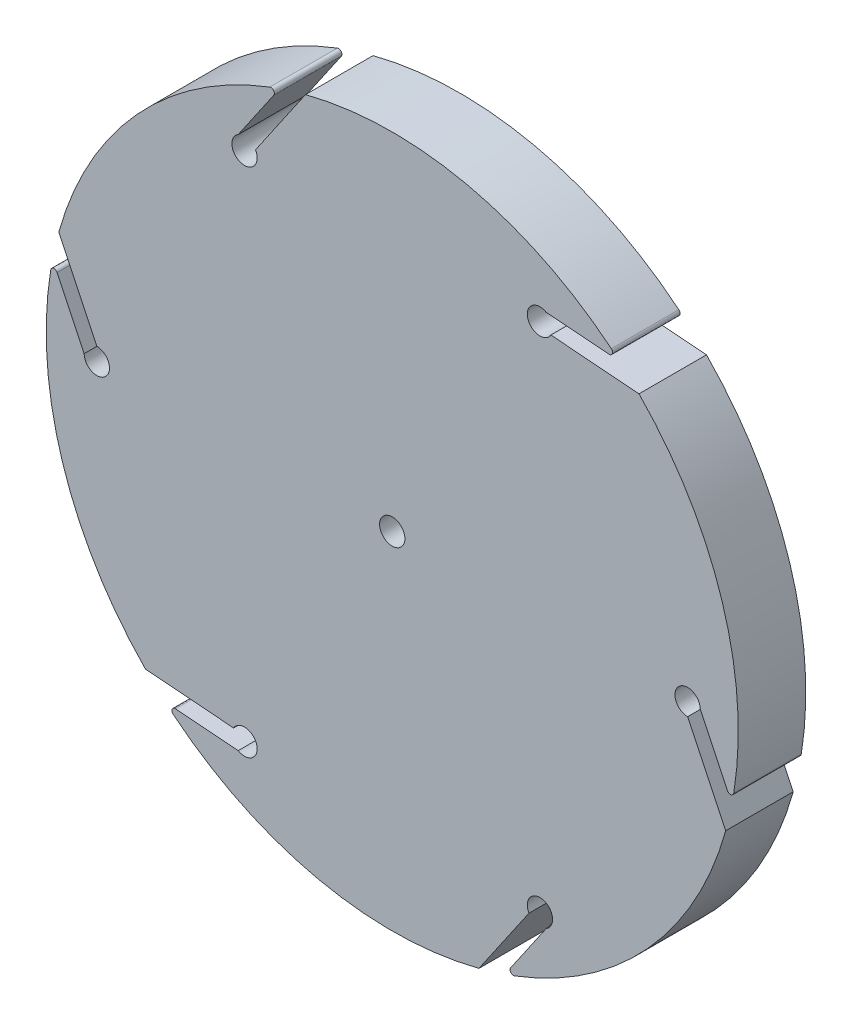
ISO-10303-21;
HEADER;
FILE_DESCRIPTION(('STEP AP214'),'2;1');
FILE_NAME('part.step','',(''),(''),'','','');
FILE_SCHEMA(('AUTOMOTIVE_DESIGN { 1 0 10303 214 1 1 1 1 }'));
ENDSEC;
DATA;
#1=APPLICATION_CONTEXT('core data for automotive mechanical design processes');
#2=APPLICATION_PROTOCOL_DEFINITION('international standard','automotive_design',2000,#1);
#3=PRODUCT_CONTEXT('',#1,'mechanical');
#4=PRODUCT('Part','Part','',(#3));
#5=PRODUCT_RELATED_PRODUCT_CATEGORY('part','',(#4));
#6=PRODUCT_DEFINITION_FORMATION('','',#4);
#7=PRODUCT_DEFINITION_CONTEXT('part definition',#1,'design');
#8=PRODUCT_DEFINITION('design','',#6,#7);
#9=PRODUCT_DEFINITION_SHAPE('','',#8);
#10=(LENGTH_UNIT() NAMED_UNIT(*) SI_UNIT(.MILLI.,.METRE.));
#11=(NAMED_UNIT(*) PLANE_ANGLE_UNIT() SI_UNIT($,.RADIAN.));
#12=(NAMED_UNIT(*) SI_UNIT($,.STERADIAN.) SOLID_ANGLE_UNIT());
#13=UNCERTAINTY_MEASURE_WITH_UNIT(LENGTH_MEASURE(1.E-05),#10,'distance_accuracy_value','');
#14=(GEOMETRIC_REPRESENTATION_CONTEXT(3) GLOBAL_UNCERTAINTY_ASSIGNED_CONTEXT((#13)) GLOBAL_UNIT_ASSIGNED_CONTEXT((#10,
#11,#12)) REPRESENTATION_CONTEXT('',''));
#15=CARTESIAN_POINT('',(0.,0.,0.));
#16=DIRECTION('',(0.,0.,1.));
#17=DIRECTION('',(1.,0.,0.));
#18=AXIS2_PLACEMENT_3D('',#15,#16,#17);
#19=CARTESIAN_POINT('',(0.,0.,4.));
#20=DIRECTION('',(0.,0.,-1.));
#21=DIRECTION('',(-1.,0.,0.));
#22=AXIS2_PLACEMENT_3D('',#19,#20,#21);
#23=CYLINDRICAL_SURFACE('',#22,20.5000000000002);
#24=CARTESIAN_POINT('',(0.,0.,4.));
#25=DIRECTION('',(0.,0.,1.));
#26=DIRECTION('',(1.,0.,0.));
#27=AXIS2_PLACEMENT_3D('',#24,#25,#26);
#28=CIRCLE('',#27,20.5000000000002);
#29=CARTESIAN_POINT('',(-12.9778392059693,-15.869016653341,4.));
#30=VERTEX_POINT('',#29);
#31=CARTESIAN_POINT('',(5.13786996078102,-19.8457121884328,4.));
#32=VERTEX_POINT('',#31);
#33=EDGE_CURVE('E399',#30,#32,#28,.T.);
#34=ORIENTED_EDGE('',*,*,#33,.F.);
#35=DIRECTION('',(0.,0.,-1.));
#36=VECTOR('',#35,1.);
#37=CARTESIAN_POINT('',(-12.9778392059693,-15.869016653341,4.));
#38=LINE('',#37,#36);
#39=CARTESIAN_POINT('',(-12.9778392059693,-15.869016653341,0.));
#40=VERTEX_POINT('',#39);
#41=EDGE_CURVE('E431',#30,#40,#38,.T.);
#42=ORIENTED_EDGE('',*,*,#41,.T.);
#43=CARTESIAN_POINT('',(0.,0.,0.));
#44=DIRECTION('',(0.,0.,1.));
#45=DIRECTION('',(1.,0.,0.));
#46=AXIS2_PLACEMENT_3D('',#43,#44,#45);
#47=CIRCLE('',#46,20.5000000000002);
#48=CARTESIAN_POINT('',(5.13786996078102,-19.8457121884328,0.));
#49=VERTEX_POINT('',#48);
#50=EDGE_CURVE('E239',#40,#49,#47,.T.);
#51=ORIENTED_EDGE('',*,*,#50,.T.);
#52=DIRECTION('',(0.,0.,1.));
#53=VECTOR('',#52,1.);
#54=CARTESIAN_POINT('',(5.13786996078102,-19.8457121884328,0.));
#55=LINE('',#54,#53);
#56=EDGE_CURVE('E281',#49,#32,#55,.T.);
#57=ORIENTED_EDGE('',*,*,#56,.T.);
#58=EDGE_LOOP('',(#34,#42,#51,#57));
#59=FACE_BOUND('',#58,.T.);
#60=ADVANCED_FACE('F32',(#59),#23,.T.);
#61=CARTESIAN_POINT('',(7.25405195188701,-19.1736467652696,4.));
#62=VERTEX_POINT('',#61);
#63=CARTESIAN_POINT('',(19.7558258917678,-5.47333018683903,4.));
#64=VERTEX_POINT('',#63);
#65=EDGE_CURVE('E476',#62,#64,#28,.T.);
#66=ORIENTED_EDGE('',*,*,#65,.F.);
#67=DIRECTION('',(0.,0.,-1.));
#68=VECTOR('',#67,1.);
#69=CARTESIAN_POINT('',(7.25405195188701,-19.1736467652696,4.));
#70=LINE('',#69,#68);
#71=CARTESIAN_POINT('',(7.25405195188701,-19.1736467652696,0.));
#72=VERTEX_POINT('',#71);
#73=EDGE_CURVE('E55',#62,#72,#70,.T.);
#74=ORIENTED_EDGE('',*,*,#73,.T.);
#75=CARTESIAN_POINT('',(19.7558258917678,-5.47333018683903,0.));
#76=VERTEX_POINT('',#75);
#77=EDGE_CURVE('E241',#72,#76,#47,.T.);
#78=ORIENTED_EDGE('',*,*,#77,.T.);
#79=DIRECTION('',(0.,0.,1.));
#80=VECTOR('',#79,1.);
#81=CARTESIAN_POINT('',(19.7558258917678,-5.47333018683903,0.));
#82=LINE('',#81,#80);
#83=EDGE_CURVE('E299',#76,#64,#82,.T.);
#84=ORIENTED_EDGE('',*,*,#83,.T.);
#85=EDGE_LOOP('',(#66,#74,#78,#84));
#86=FACE_BOUND('',#85,.T.);
#87=ADVANCED_FACE('F533',(#86),#23,.T.);
#88=CARTESIAN_POINT('',(20.2318911578563,-3.30463011192849,4.));
#89=VERTEX_POINT('',#88);
#90=CARTESIAN_POINT('',(14.6179559309867,14.3723820015938,4.));
#91=VERTEX_POINT('',#90);
#92=EDGE_CURVE('E474',#89,#91,#28,.T.);
#93=ORIENTED_EDGE('',*,*,#92,.F.);
#94=DIRECTION('',(0.,0.,-1.));
#95=VECTOR('',#94,1.);
#96=CARTESIAN_POINT('',(20.2318911578563,-3.30463011192849,4.));
#97=LINE('',#96,#95);
#98=CARTESIAN_POINT('',(20.2318911578563,-3.30463011192849,0.));
#99=VERTEX_POINT('',#98);
#100=EDGE_CURVE('E440',#89,#99,#97,.T.);
#101=ORIENTED_EDGE('',*,*,#100,.T.);
#102=CARTESIAN_POINT('',(14.6179559309867,14.3723820015938,0.));
#103=VERTEX_POINT('',#102);
#104=EDGE_CURVE('E401',#99,#103,#47,.T.);
#105=ORIENTED_EDGE('',*,*,#104,.T.);
#106=DIRECTION('',(0.,0.,1.));
#107=VECTOR('',#106,1.);
#108=CARTESIAN_POINT('',(14.6179559309867,14.3723820015938,0.));
#109=LINE('',#108,#107);
#110=EDGE_CURVE('E317',#103,#91,#109,.T.);
#111=ORIENTED_EDGE('',*,*,#110,.T.);
#112=EDGE_LOOP('',(#93,#101,#105,#111));
#113=FACE_BOUND('',#112,.T.);
#114=ADVANCED_FACE('F498',(#113),#23,.T.);
#115=CARTESIAN_POINT('',(12.9778392059692,15.8690166533411,4.));
#116=VERTEX_POINT('',#115);
#117=CARTESIAN_POINT('',(-5.13786996078117,19.8457121884328,4.));
#118=VERTEX_POINT('',#117);
#119=EDGE_CURVE('E473',#116,#118,#28,.T.);
#120=ORIENTED_EDGE('',*,*,#119,.F.);
#121=DIRECTION('',(0.,0.,-1.));
#122=VECTOR('',#121,1.);
#123=CARTESIAN_POINT('',(12.9778392059692,15.8690166533411,4.));
#124=LINE('',#123,#122);
#125=CARTESIAN_POINT('',(12.9778392059692,15.8690166533411,0.));
#126=VERTEX_POINT('',#125);
#127=EDGE_CURVE('E445',#116,#126,#124,.T.);
#128=ORIENTED_EDGE('',*,*,#127,.T.);
#129=CARTESIAN_POINT('',(-5.13786996078117,19.8457121884328,0.));
#130=VERTEX_POINT('',#129);
#131=EDGE_CURVE('E492',#126,#130,#47,.T.);
#132=ORIENTED_EDGE('',*,*,#131,.T.);
#133=DIRECTION('',(0.,0.,1.));
#134=VECTOR('',#133,1.);
#135=CARTESIAN_POINT('',(-5.13786996078117,19.8457121884328,0.));
#136=LINE('',#135,#134);
#137=EDGE_CURVE('E335',#130,#118,#136,.T.);
#138=ORIENTED_EDGE('',*,*,#137,.T.);
#139=EDGE_LOOP('',(#120,#128,#132,#138));
#140=FACE_BOUND('',#139,.T.);
#141=ADVANCED_FACE('F518',(#140),#23,.T.);
#142=CARTESIAN_POINT('',(-7.25405195188714,19.1736467652695,4.));
#143=VERTEX_POINT('',#142);
#144=CARTESIAN_POINT('',(-19.7558258917679,5.4733301868389,4.));
#145=VERTEX_POINT('',#144);
#146=EDGE_CURVE('E238',#143,#145,#28,.T.);
#147=ORIENTED_EDGE('',*,*,#146,.F.);
#148=DIRECTION('',(0.,0.,-1.));
#149=VECTOR('',#148,1.);
#150=CARTESIAN_POINT('',(-7.25405195188714,19.1736467652695,4.));
#151=LINE('',#150,#149);
#152=CARTESIAN_POINT('',(-7.25405195188714,19.1736467652695,0.));
#153=VERTEX_POINT('',#152);
#154=EDGE_CURVE('E11',#143,#153,#151,.T.);
#155=ORIENTED_EDGE('',*,*,#154,.T.);
#156=CARTESIAN_POINT('',(-19.7558258917679,5.4733301868389,0.));
#157=VERTEX_POINT('',#156);
#158=EDGE_CURVE('E394',#153,#157,#47,.T.);
#159=ORIENTED_EDGE('',*,*,#158,.T.);
#160=DIRECTION('',(0.,0.,1.));
#161=VECTOR('',#160,1.);
#162=CARTESIAN_POINT('',(-19.7558258917679,5.4733301868389,0.));
#163=LINE('',#162,#161);
#164=EDGE_CURVE('E353',#157,#145,#163,.T.);
#165=ORIENTED_EDGE('',*,*,#164,.T.);
#166=EDGE_LOOP('',(#147,#155,#159,#165));
#167=FACE_BOUND('',#166,.T.);
#168=ADVANCED_FACE('F470',(#167),#23,.T.);
#169=CARTESIAN_POINT('',(0.,0.,4.));
#170=DIRECTION('',(0.,0.,1.));
#171=DIRECTION('',(1.,0.,0.));
#172=AXIS2_PLACEMENT_3D('',#169,#170,#171);
#173=PLANE('',#172);
#174=DIRECTION('',(0.430964406271145,-0.902368927062185,0.));
#175=VECTOR('',#174,1.);
#176=CARTESIAN_POINT('',(-18.2500000000001,0.,4.));
#177=LINE('',#176,#175);
#178=CARTESIAN_POINT('',(-19.8540330684648,3.35858269940767,4.));
#179=VERTEX_POINT('',#178);
#180=CARTESIAN_POINT('',(-18.2500000000001,0.,4.));
#181=VERTEX_POINT('',#180);
#182=EDGE_CURVE('E343',#179,#181,#177,.T.);
#183=ORIENTED_EDGE('',*,*,#182,.F.);
#184=CARTESIAN_POINT('',(-20.0345068538772,3.27238981815344,4.));
#185=DIRECTION('',(0.,0.,1.));
#186=DIRECTION('',(1.,0.,0.));
#187=AXIS2_PLACEMENT_3D('',#184,#185,#186);
#188=CIRCLE('',#187,0.2);
#189=CARTESIAN_POINT('',(-20.2318911578563,3.30463011192835,4.));
#190=VERTEX_POINT('',#189);
#191=EDGE_CURVE('E414',#179,#190,#188,.T.);
#192=ORIENTED_EDGE('',*,*,#191,.T.);
#193=CARTESIAN_POINT('',(-14.6179559309868,-14.3723820015937,4.));
#194=VERTEX_POINT('',#193);
#195=EDGE_CURVE('E397',#190,#194,#28,.T.);
#196=ORIENTED_EDGE('',*,*,#195,.T.);
#197=DIRECTION('',(-0.996956617557131,0.0779583395734142,0.));
#198=VECTOR('',#197,1.);
#199=CARTESIAN_POINT('',(-9.39951905283854,-14.7804445662276,4.));
#200=LINE('',#199,#198);
#201=CARTESIAN_POINT('',(-9.39951905283854,-14.7804445662276,4.));
#202=VERTEX_POINT('',#201);
#203=EDGE_CURVE('E248',#202,#194,#200,.T.);
#204=ORIENTED_EDGE('',*,*,#203,.F.);
#205=CARTESIAN_POINT('',(-8.75000000000002,-15.1554445662277,4.));
#206=DIRECTION('',(0.,0.,1.));
#207=DIRECTION('',(1.,0.,0.));
#208=AXIS2_PLACEMENT_3D('',#205,#206,#207);
#209=CIRCLE('',#208,0.750000000000002);
#210=CARTESIAN_POINT('',(-9.12500000000022,-15.804963619066,4.));
#211=VERTEX_POINT('',#210);
#212=EDGE_CURVE('E368',#211,#202,#209,.T.);
#213=ORIENTED_EDGE('',*,*,#212,.F.);
#214=DIRECTION('',(0.996956617557131,-0.0779583395734148,0.));
#215=VECTOR('',#214,1.);
#216=CARTESIAN_POINT('',(-9.12500000000022,-15.804963619066,4.));
#217=LINE('',#216,#215);
#218=CARTESIAN_POINT('',(-12.8356344726305,-15.5148056551628,4.));
#219=VERTEX_POINT('',#218);
#220=EDGE_CURVE('E257',#219,#211,#217,.T.);
#221=ORIENTED_EDGE('',*,*,#220,.F.);
#222=CARTESIAN_POINT('',(-12.8512261405452,-15.7141969786743,4.));
#223=DIRECTION('',(0.,0.,1.));
#224=DIRECTION('',(1.,0.,0.));
#225=AXIS2_PLACEMENT_3D('',#222,#223,#224);
#226=CIRCLE('',#225,0.2);
#227=EDGE_CURVE('E412',#219,#30,#226,.T.);
#228=ORIENTED_EDGE('',*,*,#227,.T.);
#229=ORIENTED_EDGE('',*,*,#33,.T.);
#230=DIRECTION('',(-0.565992211285994,-0.824410587488777,0.));
#231=VECTOR('',#230,1.);
#232=CARTESIAN_POINT('',(8.10048094716156,-15.5304445662278,4.));
#233=LINE('',#232,#231);
#234=CARTESIAN_POINT('',(8.10048094716156,-15.5304445662278,4.));
#235=VERTEX_POINT('',#234);
#236=EDGE_CURVE('E264',#235,#32,#233,.T.);
#237=ORIENTED_EDGE('',*,*,#236,.F.);
#238=CARTESIAN_POINT('',(8.75000000000004,-15.1554445662277,4.));
#239=DIRECTION('',(0.,0.,1.));
#240=DIRECTION('',(1.,0.,0.));
#241=AXIS2_PLACEMENT_3D('',#238,#239,#240);
#242=CIRCLE('',#241,0.750000000000002);
#243=CARTESIAN_POINT('',(9.12499999999989,-15.8049636190662,4.));
#244=VERTEX_POINT('',#243);
#245=EDGE_CURVE('E373',#244,#235,#242,.T.);
#246=ORIENTED_EDGE('',*,*,#245,.F.);
#247=DIRECTION('',(0.565992211285994,0.824410587488777,0.));
#248=VECTOR('',#247,1.);
#249=CARTESIAN_POINT('',(9.12499999999989,-15.8049636190662,4.));
#250=LINE('',#249,#248);
#251=CARTESIAN_POINT('',(7.01839859583426,-18.8733883545707,4.));
#252=VERTEX_POINT('',#251);
#253=EDGE_CURVE('E271',#252,#244,#250,.T.);
#254=ORIENTED_EDGE('',*,*,#253,.F.);
#255=CARTESIAN_POINT('',(7.18328071333202,-18.9865867968279,4.));
#256=DIRECTION('',(0.,0.,1.));
#257=DIRECTION('',(1.,0.,0.));
#258=AXIS2_PLACEMENT_3D('',#255,#256,#257);
#259=CIRCLE('',#258,0.2);
#260=EDGE_CURVE('E410',#252,#62,#259,.T.);
#261=ORIENTED_EDGE('',*,*,#260,.T.);
#262=ORIENTED_EDGE('',*,*,#65,.T.);
#263=DIRECTION('',(0.43096440627114,-0.902368927062188,0.));
#264=VECTOR('',#263,1.);
#265=CARTESIAN_POINT('',(17.5000000000001,-0.750000000000124,4.));
#266=LINE('',#265,#264);
#267=CARTESIAN_POINT('',(17.5000000000001,-0.750000000000124,4.));
#268=VERTEX_POINT('',#267);
#269=EDGE_CURVE('E280',#268,#64,#266,.T.);
#270=ORIENTED_EDGE('',*,*,#269,.F.);
#271=CARTESIAN_POINT('',(17.5000000000001,0.,4.));
#272=DIRECTION('',(0.,0.,1.));
#273=DIRECTION('',(1.,0.,0.));
#274=AXIS2_PLACEMENT_3D('',#271,#272,#273);
#275=CIRCLE('',#274,0.750000000000002);
#276=CARTESIAN_POINT('',(18.2500000000001,-1.30321101132758E-13,4.));
#277=VERTEX_POINT('',#276);
#278=EDGE_CURVE('E379',#277,#268,#275,.T.);
#279=ORIENTED_EDGE('',*,*,#278,.F.);
#280=DIRECTION('',(-0.430964406271139,0.902368927062188,0.));
#281=VECTOR('',#280,1.);
#282=CARTESIAN_POINT('',(18.2500000000001,-1.27439068867775E-13,4.));
#283=LINE('',#282,#281);
#284=CARTESIAN_POINT('',(19.8540330684648,-3.3585826994078,4.));
#285=VERTEX_POINT('',#284);
#286=EDGE_CURVE('E289',#285,#277,#283,.T.);
#287=ORIENTED_EDGE('',*,*,#286,.F.);
#288=CARTESIAN_POINT('',(20.0345068538772,-3.27238981815358,4.));
#289=DIRECTION('',(0.,0.,1.));
#290=DIRECTION('',(1.,0.,0.));
#291=AXIS2_PLACEMENT_3D('',#288,#289,#290);
#292=CIRCLE('',#291,0.2);
#293=EDGE_CURVE('E408',#285,#89,#292,.T.);
#294=ORIENTED_EDGE('',*,*,#293,.T.);
#295=ORIENTED_EDGE('',*,*,#92,.T.);
#296=DIRECTION('',(0.996956617557132,-0.0779583395734075,0.));
#297=VECTOR('',#296,1.);
#298=CARTESIAN_POINT('',(9.39951905283844,14.7804445662277,4.));
#299=LINE('',#298,#297);
#300=CARTESIAN_POINT('',(9.39951905283844,14.7804445662277,4.));
#301=VERTEX_POINT('',#300);
#302=EDGE_CURVE('E298',#301,#91,#299,.T.);
#303=ORIENTED_EDGE('',*,*,#302,.F.);
#304=CARTESIAN_POINT('',(8.75000000000003,15.1554445662277,4.));
#305=DIRECTION('',(0.,0.,1.));
#306=DIRECTION('',(1.,0.,0.));
#307=AXIS2_PLACEMENT_3D('',#304,#305,#306);
#308=CIRCLE('',#307,0.750000000000002);
#309=CARTESIAN_POINT('',(9.1250000000001,15.804963619066,4.));
#310=VERTEX_POINT('',#309);
#311=EDGE_CURVE('E385',#310,#301,#308,.T.);
#312=ORIENTED_EDGE('',*,*,#311,.F.);
#313=DIRECTION('',(-0.996956617557132,0.0779583395734076,0.));
#314=VECTOR('',#313,1.);
#315=CARTESIAN_POINT('',(9.12500000000011,15.804963619066,4.));
#316=LINE('',#315,#314);
#317=CARTESIAN_POINT('',(12.8356344726304,15.5148056551629,4.));
#318=VERTEX_POINT('',#317);
#319=EDGE_CURVE('E307',#318,#310,#316,.T.);
#320=ORIENTED_EDGE('',*,*,#319,.F.);
#321=CARTESIAN_POINT('',(12.8512261405451,15.7141969786744,4.));
#322=DIRECTION('',(0.,0.,1.));
#323=DIRECTION('',(1.,0.,0.));
#324=AXIS2_PLACEMENT_3D('',#321,#322,#323);
#325=CIRCLE('',#324,0.2);
#326=EDGE_CURVE('E406',#318,#116,#325,.T.);
#327=ORIENTED_EDGE('',*,*,#326,.T.);
#328=ORIENTED_EDGE('',*,*,#119,.T.);
#329=DIRECTION('',(0.565992211285988,0.824410587488781,0.));
#330=VECTOR('',#329,1.);
#331=CARTESIAN_POINT('',(-8.10048094716167,15.5304445662278,4.));
#332=LINE('',#331,#330);
#333=CARTESIAN_POINT('',(-8.10048094716167,15.5304445662278,4.));
#334=VERTEX_POINT('',#333);
#335=EDGE_CURVE('E316',#334,#118,#332,.T.);
#336=ORIENTED_EDGE('',*,*,#335,.F.);
#337=CARTESIAN_POINT('',(-8.75000000000004,15.1554445662277,4.));
#338=DIRECTION('',(0.,0.,1.));
#339=DIRECTION('',(1.,0.,0.));
#340=AXIS2_PLACEMENT_3D('',#337,#338,#339);
#341=CIRCLE('',#340,0.75);
#342=CARTESIAN_POINT('',(-9.125,15.8049636190661,4.));
#343=VERTEX_POINT('',#342);
#344=EDGE_CURVE('E391',#343,#334,#341,.T.);
#345=ORIENTED_EDGE('',*,*,#344,.F.);
#346=DIRECTION('',(-0.565992211285989,-0.824410587488781,0.));
#347=VECTOR('',#346,1.);
#348=CARTESIAN_POINT('',(-9.125,15.8049636190661,4.));
#349=LINE('',#348,#347);
#350=CARTESIAN_POINT('',(-7.01839859583439,18.8733883545707,4.));
#351=VERTEX_POINT('',#350);
#352=EDGE_CURVE('E325',#351,#343,#349,.T.);
#353=ORIENTED_EDGE('',*,*,#352,.F.);
#354=CARTESIAN_POINT('',(-7.18328071333215,18.9865867968279,4.));
#355=DIRECTION('',(0.,0.,1.));
#356=DIRECTION('',(1.,0.,0.));
#357=AXIS2_PLACEMENT_3D('',#354,#355,#356);
#358=CIRCLE('',#357,0.2);
#359=EDGE_CURVE('E404',#351,#143,#358,.T.);
#360=ORIENTED_EDGE('',*,*,#359,.T.);
#361=ORIENTED_EDGE('',*,*,#146,.T.);
#362=DIRECTION('',(-0.430964406271146,0.902368927062185,0.));
#363=VECTOR('',#362,1.);
#364=CARTESIAN_POINT('',(-17.5000000000001,0.750000000000002,4.));
#365=LINE('',#364,#363);
#366=CARTESIAN_POINT('',(-17.5000000000001,0.750000000000002,4.));
#367=VERTEX_POINT('',#366);
#368=EDGE_CURVE('E334',#367,#145,#365,.T.);
#369=ORIENTED_EDGE('',*,*,#368,.F.);
#370=CARTESIAN_POINT('',(-17.5000000000001,0.,4.));
#371=DIRECTION('',(0.,0.,1.));
#372=DIRECTION('',(1.,0.,0.));
#373=AXIS2_PLACEMENT_3D('',#370,#371,#372);
#374=CIRCLE('',#373,0.750000000000002);
#375=EDGE_CURVE('E357',#181,#367,#374,.T.);
#376=ORIENTED_EDGE('',*,*,#375,.F.);
#377=EDGE_LOOP('',(#183,#192,#196,#204,#213,#221,#228,#229,#237,#246,#254,#261,#262,#270,#279,
#287,#294,#295,#303,#312,#320,#327,#328,#336,#345,#353,#360,#361,#369,#376));
#378=FACE_BOUND('',#377,.T.);
#379=CARTESIAN_POINT('',(0.,0.,4.));
#380=DIRECTION('',(0.,0.,1.));
#381=DIRECTION('',(1.,0.,0.));
#382=AXIS2_PLACEMENT_3D('',#379,#380,#381);
#383=CIRCLE('',#382,0.75);
#384=CARTESIAN_POINT('',(0.75,0.,4.));
#385=VERTEX_POINT('',#384);
#386=EDGE_CURVE('E363',#385,#385,#383,.T.);
#387=ORIENTED_EDGE('',*,*,#386,.F.);
#388=EDGE_LOOP('',(#387));
#389=FACE_BOUND('',#388,.T.);
#390=ADVANCED_FACE('F458',(#378,#389),#173,.T.);
#391=CARTESIAN_POINT('',(0.,0.,0.));
#392=DIRECTION('',(0.,0.,1.));
#393=DIRECTION('',(1.,0.,0.));
#394=AXIS2_PLACEMENT_3D('',#391,#392,#393);
#395=PLANE('',#394);
#396=CARTESIAN_POINT('',(0.,0.,0.));
#397=DIRECTION('',(0.,0.,1.));
#398=DIRECTION('',(1.,0.,0.));
#399=AXIS2_PLACEMENT_3D('',#396,#397,#398);
#400=CIRCLE('',#399,0.75);
#401=CARTESIAN_POINT('',(0.75,0.,0.));
#402=VERTEX_POINT('',#401);
#403=EDGE_CURVE('E360',#402,#402,#400,.T.);
#404=ORIENTED_EDGE('',*,*,#403,.T.);
#405=EDGE_LOOP('',(#404));
#406=FACE_BOUND('',#405,.T.);
#407=CARTESIAN_POINT('',(-20.2318911578563,3.30463011192835,0.));
#408=VERTEX_POINT('',#407);
#409=CARTESIAN_POINT('',(-14.6179559309868,-14.3723820015937,0.));
#410=VERTEX_POINT('',#409);
#411=EDGE_CURVE('E229',#408,#410,#47,.T.);
#412=ORIENTED_EDGE('',*,*,#411,.F.);
#413=CARTESIAN_POINT('',(-20.0345068538772,3.27238981815344,0.));
#414=DIRECTION('',(0.,0.,1.));
#415=DIRECTION('',(1.,0.,0.));
#416=AXIS2_PLACEMENT_3D('',#413,#414,#415);
#417=CIRCLE('',#416,0.2);
#418=CARTESIAN_POINT('',(-19.8540330684648,3.35858269940767,0.));
#419=VERTEX_POINT('',#418);
#420=EDGE_CURVE('E426',#408,#419,#417,.F.);
#421=ORIENTED_EDGE('',*,*,#420,.T.);
#422=DIRECTION('',(0.430964406271145,-0.902368927062185,0.));
#423=VECTOR('',#422,1.);
#424=CARTESIAN_POINT('',(-18.2500000000001,0.,0.));
#425=LINE('',#424,#423);
#426=CARTESIAN_POINT('',(-18.2500000000001,0.,0.));
#427=VERTEX_POINT('',#426);
#428=EDGE_CURVE('E342',#419,#427,#425,.T.);
#429=ORIENTED_EDGE('',*,*,#428,.T.);
#430=CARTESIAN_POINT('',(-17.5000000000001,0.,0.));
#431=DIRECTION('',(0.,0.,1.));
#432=DIRECTION('',(1.,0.,0.));
#433=AXIS2_PLACEMENT_3D('',#430,#431,#432);
#434=CIRCLE('',#433,0.750000000000002);
#435=CARTESIAN_POINT('',(-17.5000000000001,0.750000000000002,0.));
#436=VERTEX_POINT('',#435);
#437=EDGE_CURVE('E352',#427,#436,#434,.T.);
#438=ORIENTED_EDGE('',*,*,#437,.T.);
#439=DIRECTION('',(-0.430964406271146,0.902368927062185,0.));
#440=VECTOR('',#439,1.);
#441=CARTESIAN_POINT('',(-17.5000000000001,0.750000000000002,0.));
#442=LINE('',#441,#440);
#443=EDGE_CURVE('E339',#436,#157,#442,.T.);
#444=ORIENTED_EDGE('',*,*,#443,.T.);
#445=ORIENTED_EDGE('',*,*,#158,.F.);
#446=CARTESIAN_POINT('',(-7.18328071333215,18.9865867968279,0.));
#447=DIRECTION('',(0.,0.,1.));
#448=DIRECTION('',(1.,0.,0.));
#449=AXIS2_PLACEMENT_3D('',#446,#447,#448);
#450=CIRCLE('',#449,0.2);
#451=CARTESIAN_POINT('',(-7.01839859583439,18.8733883545707,0.));
#452=VERTEX_POINT('',#451);
#453=EDGE_CURVE('E417',#153,#452,#450,.F.);
#454=ORIENTED_EDGE('',*,*,#453,.T.);
#455=DIRECTION('',(-0.565992211285989,-0.824410587488781,0.));
#456=VECTOR('',#455,1.);
#457=CARTESIAN_POINT('',(-9.125,15.8049636190661,0.));
#458=LINE('',#457,#456);
#459=CARTESIAN_POINT('',(-9.125,15.8049636190661,0.));
#460=VERTEX_POINT('',#459);
#461=EDGE_CURVE('E324',#452,#460,#458,.T.);
#462=ORIENTED_EDGE('',*,*,#461,.T.);
#463=CARTESIAN_POINT('',(-8.75000000000004,15.1554445662277,0.));
#464=DIRECTION('',(0.,0.,1.));
#465=DIRECTION('',(1.,0.,0.));
#466=AXIS2_PLACEMENT_3D('',#463,#464,#465);
#467=CIRCLE('',#466,0.75);
#468=CARTESIAN_POINT('',(-8.10048094716171,15.5304445662277,0.));
#469=VERTEX_POINT('',#468);
#470=EDGE_CURVE('E388',#460,#469,#467,.T.);
#471=ORIENTED_EDGE('',*,*,#470,.T.);
#472=DIRECTION('',(0.565992211285988,0.824410587488781,0.));
#473=VECTOR('',#472,1.);
#474=CARTESIAN_POINT('',(-8.10048094716167,15.5304445662278,0.));
#475=LINE('',#474,#473);
#476=EDGE_CURVE('E321',#469,#130,#475,.T.);
#477=ORIENTED_EDGE('',*,*,#476,.T.);
#478=ORIENTED_EDGE('',*,*,#131,.F.);
#479=CARTESIAN_POINT('',(12.8512261405451,15.7141969786744,0.));
#480=DIRECTION('',(0.,0.,1.));
#481=DIRECTION('',(1.,0.,0.));
#482=AXIS2_PLACEMENT_3D('',#479,#480,#481);
#483=CIRCLE('',#482,0.2);
#484=CARTESIAN_POINT('',(12.8356344726304,15.5148056551629,0.));
#485=VERTEX_POINT('',#484);
#486=EDGE_CURVE('E419',#126,#485,#483,.F.);
#487=ORIENTED_EDGE('',*,*,#486,.T.);
#488=DIRECTION('',(-0.996956617557132,0.0779583395734076,0.));
#489=VECTOR('',#488,1.);
#490=CARTESIAN_POINT('',(9.12500000000011,15.804963619066,0.));
#491=LINE('',#490,#489);
#492=CARTESIAN_POINT('',(9.12500000000011,15.804963619066,0.));
#493=VERTEX_POINT('',#492);
#494=EDGE_CURVE('E306',#485,#493,#491,.T.);
#495=ORIENTED_EDGE('',*,*,#494,.T.);
#496=CARTESIAN_POINT('',(8.75000000000003,15.1554445662277,0.));
#497=DIRECTION('',(0.,0.,1.));
#498=DIRECTION('',(1.,0.,0.));
#499=AXIS2_PLACEMENT_3D('',#496,#497,#498);
#500=CIRCLE('',#499,0.750000000000002);
#501=CARTESIAN_POINT('',(9.39951905283834,14.7804445662277,0.));
#502=VERTEX_POINT('',#501);
#503=EDGE_CURVE('E382',#493,#502,#500,.T.);
#504=ORIENTED_EDGE('',*,*,#503,.T.);
#505=DIRECTION('',(0.996956617557132,-0.0779583395734075,0.));
#506=VECTOR('',#505,1.);
#507=CARTESIAN_POINT('',(9.39951905283844,14.7804445662277,0.));
#508=LINE('',#507,#506);
#509=EDGE_CURVE('E303',#502,#103,#508,.T.);
#510=ORIENTED_EDGE('',*,*,#509,.T.);
#511=ORIENTED_EDGE('',*,*,#104,.F.);
#512=CARTESIAN_POINT('',(20.0345068538772,-3.27238981815358,0.));
#513=DIRECTION('',(0.,0.,1.));
#514=DIRECTION('',(1.,0.,0.));
#515=AXIS2_PLACEMENT_3D('',#512,#513,#514);
#516=CIRCLE('',#515,0.2);
#517=CARTESIAN_POINT('',(19.8540330684648,-3.3585826994078,0.));
#518=VERTEX_POINT('',#517);
#519=EDGE_CURVE('E421',#99,#518,#516,.F.);
#520=ORIENTED_EDGE('',*,*,#519,.T.);
#521=DIRECTION('',(-0.430964406271139,0.902368927062188,0.));
#522=VECTOR('',#521,1.);
#523=CARTESIAN_POINT('',(18.2500000000001,-1.27439068867775E-13,0.));
#524=LINE('',#523,#522);
#525=CARTESIAN_POINT('',(18.2500000000001,-1.27439068867775E-13,0.));
#526=VERTEX_POINT('',#525);
#527=EDGE_CURVE('E288',#518,#526,#524,.T.);
#528=ORIENTED_EDGE('',*,*,#527,.T.);
#529=CARTESIAN_POINT('',(17.5000000000001,0.,0.));
#530=DIRECTION('',(0.,0.,1.));
#531=DIRECTION('',(1.,0.,0.));
#532=AXIS2_PLACEMENT_3D('',#529,#530,#531);
#533=CIRCLE('',#532,0.750000000000002);
#534=CARTESIAN_POINT('',(17.5,-0.75,0.));
#535=VERTEX_POINT('',#534);
#536=EDGE_CURVE('E376',#526,#535,#533,.T.);
#537=ORIENTED_EDGE('',*,*,#536,.T.);
#538=DIRECTION('',(0.43096440627114,-0.902368927062188,0.));
#539=VECTOR('',#538,1.);
#540=CARTESIAN_POINT('',(17.5000000000001,-0.750000000000124,0.));
#541=LINE('',#540,#539);
#542=EDGE_CURVE('E285',#535,#76,#541,.T.);
#543=ORIENTED_EDGE('',*,*,#542,.T.);
#544=ORIENTED_EDGE('',*,*,#77,.F.);
#545=CARTESIAN_POINT('',(7.18328071333202,-18.9865867968279,0.));
#546=DIRECTION('',(0.,0.,1.));
#547=DIRECTION('',(1.,0.,0.));
#548=AXIS2_PLACEMENT_3D('',#545,#546,#547);
#549=CIRCLE('',#548,0.2);
#550=CARTESIAN_POINT('',(7.01839859583426,-18.8733883545707,0.));
#551=VERTEX_POINT('',#550);
#552=EDGE_CURVE('E47',#72,#551,#549,.F.);
#553=ORIENTED_EDGE('',*,*,#552,.T.);
#554=DIRECTION('',(0.565992211285994,0.824410587488777,0.));
#555=VECTOR('',#554,1.);
#556=CARTESIAN_POINT('',(9.12499999999989,-15.8049636190662,0.));
#557=LINE('',#556,#555);
#558=CARTESIAN_POINT('',(9.12499999999989,-15.8049636190662,0.));
#559=VERTEX_POINT('',#558);
#560=EDGE_CURVE('E270',#551,#559,#557,.T.);
#561=ORIENTED_EDGE('',*,*,#560,.T.);
#562=CARTESIAN_POINT('',(8.75000000000004,-15.1554445662277,0.));
#563=DIRECTION('',(0.,0.,1.));
#564=DIRECTION('',(1.,0.,0.));
#565=AXIS2_PLACEMENT_3D('',#562,#563,#564);
#566=CIRCLE('',#565,0.750000000000002);
#567=CARTESIAN_POINT('',(8.10048094716171,-15.5304445662277,0.));
#568=VERTEX_POINT('',#567);
#569=EDGE_CURVE('E371',#559,#568,#566,.T.);
#570=ORIENTED_EDGE('',*,*,#569,.T.);
#571=DIRECTION('',(-0.565992211285994,-0.824410587488777,0.));
#572=VECTOR('',#571,1.);
#573=CARTESIAN_POINT('',(8.10048094716156,-15.5304445662278,0.));
#574=LINE('',#573,#572);
#575=EDGE_CURVE('E267',#568,#49,#574,.T.);
#576=ORIENTED_EDGE('',*,*,#575,.T.);
#577=ORIENTED_EDGE('',*,*,#50,.F.);
#578=CARTESIAN_POINT('',(-12.8512261405452,-15.7141969786743,0.));
#579=DIRECTION('',(0.,0.,1.));
#580=DIRECTION('',(1.,0.,0.));
#581=AXIS2_PLACEMENT_3D('',#578,#579,#580);
#582=CIRCLE('',#581,0.2);
#583=CARTESIAN_POINT('',(-12.8356344726305,-15.5148056551628,0.));
#584=VERTEX_POINT('',#583);
#585=EDGE_CURVE('E424',#40,#584,#582,.F.);
#586=ORIENTED_EDGE('',*,*,#585,.T.);
#587=DIRECTION('',(0.996956617557131,-0.0779583395734148,0.));
#588=VECTOR('',#587,1.);
#589=CARTESIAN_POINT('',(-9.12500000000022,-15.804963619066,0.));
#590=LINE('',#589,#588);
#591=CARTESIAN_POINT('',(-9.12500000000022,-15.804963619066,0.));
#592=VERTEX_POINT('',#591);
#593=EDGE_CURVE('E256',#584,#592,#590,.T.);
#594=ORIENTED_EDGE('',*,*,#593,.T.);
#595=CARTESIAN_POINT('',(-8.75000000000002,-15.1554445662277,0.));
#596=DIRECTION('',(0.,0.,1.));
#597=DIRECTION('',(1.,0.,0.));
#598=AXIS2_PLACEMENT_3D('',#595,#596,#597);
#599=CIRCLE('',#598,0.750000000000002);
#600=CARTESIAN_POINT('',(-9.39951905283835,-14.7804445662277,0.));
#601=VERTEX_POINT('',#600);
#602=EDGE_CURVE('E255',#592,#601,#599,.T.);
#603=ORIENTED_EDGE('',*,*,#602,.T.);
#604=DIRECTION('',(-0.996956617557131,0.0779583395734142,0.));
#605=VECTOR('',#604,1.);
#606=CARTESIAN_POINT('',(-9.39951905283854,-14.7804445662276,0.));
#607=LINE('',#606,#605);
#608=EDGE_CURVE('E245',#601,#410,#607,.T.);
#609=ORIENTED_EDGE('',*,*,#608,.T.);
#610=EDGE_LOOP('',(#412,#421,#429,#438,#444,#445,#454,#462,#471,#477,#478,#487,#495,#504,#510,
#511,#520,#528,#537,#543,#544,#553,#561,#570,#576,#577,#586,#594,#603,#609));
#611=FACE_BOUND('',#610,.T.);
#612=ADVANCED_FACE('F253',(#406,#611),#395,.F.);
#613=ORIENTED_EDGE('',*,*,#195,.F.);
#614=DIRECTION('',(0.,0.,-1.));
#615=VECTOR('',#614,1.);
#616=CARTESIAN_POINT('',(-20.2318911578563,3.30463011192835,4.));
#617=LINE('',#616,#615);
#618=EDGE_CURVE('E235',#190,#408,#617,.T.);
#619=ORIENTED_EDGE('',*,*,#618,.T.);
#620=ORIENTED_EDGE('',*,*,#411,.T.);
#621=DIRECTION('',(0.,0.,1.));
#622=VECTOR('',#621,1.);
#623=CARTESIAN_POINT('',(-14.6179559309868,-14.3723820015937,0.));
#624=LINE('',#623,#622);
#625=EDGE_CURVE('E233',#410,#194,#624,.T.);
#626=ORIENTED_EDGE('',*,*,#625,.T.);
#627=EDGE_LOOP('',(#613,#619,#620,#626));
#628=FACE_BOUND('',#627,.T.);
#629=ADVANCED_FACE('F232',(#628),#23,.T.);
#630=CARTESIAN_POINT('',(-8.75000000000004,15.1554445662277,4.));
#631=DIRECTION('',(0.,0.,-1.));
#632=DIRECTION('',(-1.,0.,0.));
#633=AXIS2_PLACEMENT_3D('',#630,#631,#632);
#634=CYLINDRICAL_SURFACE('',#633,0.75);
#635=DIRECTION('',(0.,0.,1.));
#636=VECTOR('',#635,1.);
#637=CARTESIAN_POINT('',(-9.125,15.8049636190661,0.));
#638=LINE('',#637,#636);
#639=EDGE_CURVE('E331',#460,#343,#638,.T.);
#640=ORIENTED_EDGE('',*,*,#639,.T.);
#641=ORIENTED_EDGE('',*,*,#344,.T.);
#642=DIRECTION('',(0.,0.,1.));
#643=VECTOR('',#642,1.);
#644=CARTESIAN_POINT('',(-8.10048094716167,15.5304445662278,0.));
#645=LINE('',#644,#643);
#646=EDGE_CURVE('E327',#469,#334,#645,.T.);
#647=ORIENTED_EDGE('',*,*,#646,.F.);
#648=ORIENTED_EDGE('',*,*,#470,.F.);
#649=EDGE_LOOP('',(#640,#641,#647,#648));
#650=FACE_BOUND('',#649,.T.);
#651=ADVANCED_FACE('F464',(#650),#634,.F.);
#652=CARTESIAN_POINT('',(8.75000000000003,15.1554445662277,4.));
#653=DIRECTION('',(0.,0.,-1.));
#654=DIRECTION('',(-1.,0.,0.));
#655=AXIS2_PLACEMENT_3D('',#652,#653,#654);
#656=CYLINDRICAL_SURFACE('',#655,0.750000000000002);
#657=DIRECTION('',(0.,0.,1.));
#658=VECTOR('',#657,1.);
#659=CARTESIAN_POINT('',(9.12500000000011,15.804963619066,0.));
#660=LINE('',#659,#658);
#661=EDGE_CURVE('E313',#493,#310,#660,.T.);
#662=ORIENTED_EDGE('',*,*,#661,.T.);
#663=ORIENTED_EDGE('',*,*,#311,.T.);
#664=DIRECTION('',(0.,0.,1.));
#665=VECTOR('',#664,1.);
#666=CARTESIAN_POINT('',(9.39951905283844,14.7804445662277,0.));
#667=LINE('',#666,#665);
#668=EDGE_CURVE('E309',#502,#301,#667,.T.);
#669=ORIENTED_EDGE('',*,*,#668,.F.);
#670=ORIENTED_EDGE('',*,*,#503,.F.);
#671=EDGE_LOOP('',(#662,#663,#669,#670));
#672=FACE_BOUND('',#671,.T.);
#673=ADVANCED_FACE('F508',(#672),#656,.F.);
#674=CARTESIAN_POINT('',(17.5000000000001,0.,4.));
#675=DIRECTION('',(0.,0.,-1.));
#676=DIRECTION('',(-1.,0.,0.));
#677=AXIS2_PLACEMENT_3D('',#674,#675,#676);
#678=CYLINDRICAL_SURFACE('',#677,0.750000000000002);
#679=DIRECTION('',(0.,0.,1.));
#680=VECTOR('',#679,1.);
#681=CARTESIAN_POINT('',(18.2500000000001,-1.27439068867775E-13,0.));
#682=LINE('',#681,#680);
#683=EDGE_CURVE('E295',#526,#277,#682,.T.);
#684=ORIENTED_EDGE('',*,*,#683,.T.);
#685=ORIENTED_EDGE('',*,*,#278,.T.);
#686=DIRECTION('',(0.,0.,1.));
#687=VECTOR('',#686,1.);
#688=CARTESIAN_POINT('',(17.5000000000001,-0.750000000000124,0.));
#689=LINE('',#688,#687);
#690=EDGE_CURVE('E291',#535,#268,#689,.T.);
#691=ORIENTED_EDGE('',*,*,#690,.F.);
#692=ORIENTED_EDGE('',*,*,#536,.F.);
#693=EDGE_LOOP('',(#684,#685,#691,#692));
#694=FACE_BOUND('',#693,.T.);
#695=ADVANCED_FACE('F660',(#694),#678,.F.);
#696=CARTESIAN_POINT('',(8.75000000000004,-15.1554445662277,4.));
#697=DIRECTION('',(0.,0.,-1.));
#698=DIRECTION('',(-1.,0.,0.));
#699=AXIS2_PLACEMENT_3D('',#696,#697,#698);
#700=CYLINDRICAL_SURFACE('',#699,0.750000000000002);
#701=DIRECTION('',(0.,0.,1.));
#702=VECTOR('',#701,1.);
#703=CARTESIAN_POINT('',(9.12499999999989,-15.8049636190662,0.));
#704=LINE('',#703,#702);
#705=EDGE_CURVE('E277',#559,#244,#704,.T.);
#706=ORIENTED_EDGE('',*,*,#705,.T.);
#707=ORIENTED_EDGE('',*,*,#245,.T.);
#708=DIRECTION('',(0.,0.,1.));
#709=VECTOR('',#708,1.);
#710=CARTESIAN_POINT('',(8.10048094716156,-15.5304445662278,0.));
#711=LINE('',#710,#709);
#712=EDGE_CURVE('E273',#568,#235,#711,.T.);
#713=ORIENTED_EDGE('',*,*,#712,.F.);
#714=ORIENTED_EDGE('',*,*,#569,.F.);
#715=EDGE_LOOP('',(#706,#707,#713,#714));
#716=FACE_BOUND('',#715,.T.);
#717=ADVANCED_FACE('F650',(#716),#700,.F.);
#718=CARTESIAN_POINT('',(-8.75000000000002,-15.1554445662277,4.));
#719=DIRECTION('',(0.,0.,-1.));
#720=DIRECTION('',(-1.,0.,0.));
#721=AXIS2_PLACEMENT_3D('',#718,#719,#720);
#722=CYLINDRICAL_SURFACE('',#721,0.750000000000002);
#723=DIRECTION('',(0.,0.,1.));
#724=VECTOR('',#723,1.);
#725=CARTESIAN_POINT('',(-9.12500000000022,-15.804963619066,0.));
#726=LINE('',#725,#724);
#727=EDGE_CURVE('E249',#592,#211,#726,.T.);
#728=ORIENTED_EDGE('',*,*,#727,.T.);
#729=ORIENTED_EDGE('',*,*,#212,.T.);
#730=DIRECTION('',(0.,0.,1.));
#731=VECTOR('',#730,1.);
#732=CARTESIAN_POINT('',(-9.39951905283854,-14.7804445662276,0.));
#733=LINE('',#732,#731);
#734=EDGE_CURVE('E250',#601,#202,#733,.T.);
#735=ORIENTED_EDGE('',*,*,#734,.F.);
#736=ORIENTED_EDGE('',*,*,#602,.F.);
#737=EDGE_LOOP('',(#728,#729,#735,#736));
#738=FACE_BOUND('',#737,.T.);
#739=ADVANCED_FACE('F645',(#738),#722,.F.);
#740=CARTESIAN_POINT('',(0.,0.,4.));
#741=DIRECTION('',(0.,0.,-1.));
#742=DIRECTION('',(-1.,0.,0.));
#743=AXIS2_PLACEMENT_3D('',#740,#741,#742);
#744=CYLINDRICAL_SURFACE('',#743,0.75);
#745=ORIENTED_EDGE('',*,*,#386,.T.);
#746=EDGE_LOOP('',(#745));
#747=FACE_BOUND('',#746,.T.);
#748=ORIENTED_EDGE('',*,*,#403,.F.);
#749=EDGE_LOOP('',(#748));
#750=FACE_BOUND('',#749,.T.);
#751=ADVANCED_FACE('F636',(#747,#750),#744,.F.);
#752=CARTESIAN_POINT('',(-17.5000000000001,0.,4.));
#753=DIRECTION('',(0.,0.,-1.));
#754=DIRECTION('',(-1.,0.,0.));
#755=AXIS2_PLACEMENT_3D('',#752,#753,#754);
#756=CYLINDRICAL_SURFACE('',#755,0.750000000000002);
#757=DIRECTION('',(0.,0.,1.));
#758=VECTOR('',#757,1.);
#759=CARTESIAN_POINT('',(-18.2500000000001,0.,0.));
#760=LINE('',#759,#758);
#761=EDGE_CURVE('E349',#427,#181,#760,.T.);
#762=ORIENTED_EDGE('',*,*,#761,.T.);
#763=ORIENTED_EDGE('',*,*,#375,.T.);
#764=DIRECTION('',(0.,0.,1.));
#765=VECTOR('',#764,1.);
#766=CARTESIAN_POINT('',(-17.5000000000001,0.750000000000002,0.));
#767=LINE('',#766,#765);
#768=EDGE_CURVE('E345',#436,#367,#767,.T.);
#769=ORIENTED_EDGE('',*,*,#768,.F.);
#770=ORIENTED_EDGE('',*,*,#437,.F.);
#771=EDGE_LOOP('',(#762,#763,#769,#770));
#772=FACE_BOUND('',#771,.T.);
#773=ADVANCED_FACE('F626',(#772),#756,.F.);
#774=CARTESIAN_POINT('',(-17.5000000000001,0.750000000000002,0.));
#775=DIRECTION('',(0.902368927062185,0.430964406271146,0.));
#776=DIRECTION('',(-0.430964406271146,0.902368927062185,0.));
#777=AXIS2_PLACEMENT_3D('',#774,#775,#776);
#778=PLANE('',#777);
#779=ORIENTED_EDGE('',*,*,#368,.T.);
#780=ORIENTED_EDGE('',*,*,#164,.F.);
#781=ORIENTED_EDGE('',*,*,#443,.F.);
#782=ORIENTED_EDGE('',*,*,#768,.T.);
#783=EDGE_LOOP('',(#779,#780,#781,#782));
#784=FACE_BOUND('',#783,.T.);
#785=ADVANCED_FACE('F529',(#784),#778,.F.);
#786=CARTESIAN_POINT('',(-18.2500000000001,0.,0.));
#787=DIRECTION('',(-0.902368927062185,-0.430964406271145,0.));
#788=DIRECTION('',(0.430964406271145,-0.902368927062185,0.));
#789=AXIS2_PLACEMENT_3D('',#786,#787,#788);
#790=PLANE('',#789);
#791=ORIENTED_EDGE('',*,*,#428,.F.);
#792=DIRECTION('',(0.,0.,-1.));
#793=VECTOR('',#792,1.);
#794=CARTESIAN_POINT('',(-19.8540330684648,3.35858269940767,0.));
#795=LINE('',#794,#793);
#796=EDGE_CURVE('E398',#419,#179,#795,.F.);
#797=ORIENTED_EDGE('',*,*,#796,.T.);
#798=ORIENTED_EDGE('',*,*,#182,.T.);
#799=ORIENTED_EDGE('',*,*,#761,.F.);
#800=EDGE_LOOP('',(#791,#797,#798,#799));
#801=FACE_BOUND('',#800,.T.);
#802=ADVANCED_FACE('F522',(#801),#790,.F.);
#803=CARTESIAN_POINT('',(-8.10048094716167,15.5304445662278,0.));
#804=DIRECTION('',(0.824410587488781,-0.565992211285988,0.));
#805=DIRECTION('',(0.565992211285988,0.824410587488781,0.));
#806=AXIS2_PLACEMENT_3D('',#803,#804,#805);
#807=PLANE('',#806);
#808=ORIENTED_EDGE('',*,*,#335,.T.);
#809=ORIENTED_EDGE('',*,*,#137,.F.);
#810=ORIENTED_EDGE('',*,*,#476,.F.);
#811=ORIENTED_EDGE('',*,*,#646,.T.);
#812=EDGE_LOOP('',(#808,#809,#810,#811));
#813=FACE_BOUND('',#812,.T.);
#814=ADVANCED_FACE('F520',(#813),#807,.F.);
#815=CARTESIAN_POINT('',(-9.125,15.8049636190661,0.));
#816=DIRECTION('',(-0.824410587488781,0.565992211285989,0.));
#817=DIRECTION('',(-0.565992211285989,-0.824410587488781,0.));
#818=AXIS2_PLACEMENT_3D('',#815,#816,#817);
#819=PLANE('',#818);
#820=ORIENTED_EDGE('',*,*,#461,.F.);
#821=DIRECTION('',(0.,0.,-1.));
#822=VECTOR('',#821,1.);
#823=CARTESIAN_POINT('',(-7.01839859583439,18.8733883545707,0.));
#824=LINE('',#823,#822);
#825=EDGE_CURVE('E40',#452,#351,#824,.F.);
#826=ORIENTED_EDGE('',*,*,#825,.T.);
#827=ORIENTED_EDGE('',*,*,#352,.T.);
#828=ORIENTED_EDGE('',*,*,#639,.F.);
#829=EDGE_LOOP('',(#820,#826,#827,#828));
#830=FACE_BOUND('',#829,.T.);
#831=ADVANCED_FACE('F451',(#830),#819,.F.);
#832=CARTESIAN_POINT('',(9.39951905283844,14.7804445662277,0.));
#833=DIRECTION('',(-0.0779583395734075,-0.996956617557132,0.));
#834=DIRECTION('',(0.996956617557132,-0.0779583395734075,0.));
#835=AXIS2_PLACEMENT_3D('',#832,#833,#834);
#836=PLANE('',#835);
#837=ORIENTED_EDGE('',*,*,#302,.T.);
#838=ORIENTED_EDGE('',*,*,#110,.F.);
#839=ORIENTED_EDGE('',*,*,#509,.F.);
#840=ORIENTED_EDGE('',*,*,#668,.T.);
#841=EDGE_LOOP('',(#837,#838,#839,#840));
#842=FACE_BOUND('',#841,.T.);
#843=ADVANCED_FACE('F502',(#842),#836,.F.);
#844=CARTESIAN_POINT('',(9.12500000000011,15.804963619066,0.));
#845=DIRECTION('',(0.0779583395734076,0.996956617557132,0.));
#846=DIRECTION('',(-0.996956617557132,0.0779583395734076,0.));
#847=AXIS2_PLACEMENT_3D('',#844,#845,#846);
#848=PLANE('',#847);
#849=ORIENTED_EDGE('',*,*,#494,.F.);
#850=DIRECTION('',(0.,0.,-1.));
#851=VECTOR('',#850,1.);
#852=CARTESIAN_POINT('',(12.8356344726304,15.5148056551629,0.));
#853=LINE('',#852,#851);
#854=EDGE_CURVE('E442',#485,#318,#853,.F.);
#855=ORIENTED_EDGE('',*,*,#854,.T.);
#856=ORIENTED_EDGE('',*,*,#319,.T.);
#857=ORIENTED_EDGE('',*,*,#661,.F.);
#858=EDGE_LOOP('',(#849,#855,#856,#857));
#859=FACE_BOUND('',#858,.T.);
#860=ADVANCED_FACE('F512',(#859),#848,.F.);
#861=CARTESIAN_POINT('',(17.5000000000001,-0.750000000000124,0.));
#862=DIRECTION('',(-0.902368927062188,-0.43096440627114,0.));
#863=DIRECTION('',(0.43096440627114,-0.902368927062188,0.));
#864=AXIS2_PLACEMENT_3D('',#861,#862,#863);
#865=PLANE('',#864);
#866=ORIENTED_EDGE('',*,*,#269,.T.);
#867=ORIENTED_EDGE('',*,*,#83,.F.);
#868=ORIENTED_EDGE('',*,*,#542,.F.);
#869=ORIENTED_EDGE('',*,*,#690,.T.);
#870=EDGE_LOOP('',(#866,#867,#868,#869));
#871=FACE_BOUND('',#870,.T.);
#872=ADVANCED_FACE('F597',(#871),#865,.F.);
#873=CARTESIAN_POINT('',(18.2500000000001,-1.27439068867775E-13,0.));
#874=DIRECTION('',(0.902368927062188,0.430964406271139,0.));
#875=DIRECTION('',(-0.430964406271139,0.902368927062188,0.));
#876=AXIS2_PLACEMENT_3D('',#873,#874,#875);
#877=PLANE('',#876);
#878=ORIENTED_EDGE('',*,*,#527,.F.);
#879=DIRECTION('',(0.,0.,-1.));
#880=VECTOR('',#879,1.);
#881=CARTESIAN_POINT('',(19.8540330684648,-3.35858269940781,0.));
#882=LINE('',#881,#880);
#883=EDGE_CURVE('E437',#518,#285,#882,.F.);
#884=ORIENTED_EDGE('',*,*,#883,.T.);
#885=ORIENTED_EDGE('',*,*,#286,.T.);
#886=ORIENTED_EDGE('',*,*,#683,.F.);
#887=EDGE_LOOP('',(#878,#884,#885,#886));
#888=FACE_BOUND('',#887,.T.);
#889=ADVANCED_FACE('F590',(#888),#877,.F.);
#890=CARTESIAN_POINT('',(8.10048094716156,-15.5304445662278,0.));
#891=DIRECTION('',(-0.824410587488777,0.565992211285994,0.));
#892=DIRECTION('',(-0.565992211285994,-0.824410587488777,0.));
#893=AXIS2_PLACEMENT_3D('',#890,#891,#892);
#894=PLANE('',#893);
#895=ORIENTED_EDGE('',*,*,#236,.T.);
#896=ORIENTED_EDGE('',*,*,#56,.F.);
#897=ORIENTED_EDGE('',*,*,#575,.F.);
#898=ORIENTED_EDGE('',*,*,#712,.T.);
#899=EDGE_LOOP('',(#895,#896,#897,#898));
#900=FACE_BOUND('',#899,.T.);
#901=ADVANCED_FACE('F488',(#900),#894,.F.);
#902=CARTESIAN_POINT('',(9.12499999999989,-15.8049636190662,0.));
#903=DIRECTION('',(0.824410587488777,-0.565992211285994,0.));
#904=DIRECTION('',(0.565992211285994,0.824410587488777,0.));
#905=AXIS2_PLACEMENT_3D('',#902,#903,#904);
#906=PLANE('',#905);
#907=ORIENTED_EDGE('',*,*,#560,.F.);
#908=DIRECTION('',(0.,0.,-1.));
#909=VECTOR('',#908,1.);
#910=CARTESIAN_POINT('',(7.01839859583426,-18.8733883545707,0.));
#911=LINE('',#910,#909);
#912=EDGE_CURVE('E433',#551,#252,#911,.F.);
#913=ORIENTED_EDGE('',*,*,#912,.T.);
#914=ORIENTED_EDGE('',*,*,#253,.T.);
#915=ORIENTED_EDGE('',*,*,#705,.F.);
#916=EDGE_LOOP('',(#907,#913,#914,#915));
#917=FACE_BOUND('',#916,.T.);
#918=ADVANCED_FACE('F577',(#917),#906,.F.);
#919=CARTESIAN_POINT('',(-9.39951905283854,-14.7804445662276,0.));
#920=DIRECTION('',(0.0779583395734142,0.996956617557131,0.));
#921=DIRECTION('',(-0.996956617557131,0.0779583395734142,0.));
#922=AXIS2_PLACEMENT_3D('',#919,#920,#921);
#923=PLANE('',#922);
#924=ORIENTED_EDGE('',*,*,#203,.T.);
#925=ORIENTED_EDGE('',*,*,#625,.F.);
#926=ORIENTED_EDGE('',*,*,#608,.F.);
#927=ORIENTED_EDGE('',*,*,#734,.T.);
#928=EDGE_LOOP('',(#924,#925,#926,#927));
#929=FACE_BOUND('',#928,.T.);
#930=ADVANCED_FACE('F244',(#929),#923,.F.);
#931=CARTESIAN_POINT('',(-9.12500000000022,-15.804963619066,0.));
#932=DIRECTION('',(-0.0779583395734149,-0.996956617557131,0.));
#933=DIRECTION('',(0.996956617557131,-0.0779583395734149,0.));
#934=AXIS2_PLACEMENT_3D('',#931,#932,#933);
#935=PLANE('',#934);
#936=ORIENTED_EDGE('',*,*,#593,.F.);
#937=DIRECTION('',(0.,0.,-1.));
#938=VECTOR('',#937,1.);
#939=CARTESIAN_POINT('',(-12.8356344726305,-15.5148056551628,0.));
#940=LINE('',#939,#938);
#941=EDGE_CURVE('E428',#584,#219,#940,.F.);
#942=ORIENTED_EDGE('',*,*,#941,.T.);
#943=ORIENTED_EDGE('',*,*,#220,.T.);
#944=ORIENTED_EDGE('',*,*,#727,.F.);
#945=EDGE_LOOP('',(#936,#942,#943,#944));
#946=FACE_BOUND('',#945,.T.);
#947=ADVANCED_FACE('F576',(#946),#935,.F.);
#948=CARTESIAN_POINT('',(-20.0345068538772,3.27238981815344,4.));
#949=DIRECTION('',(0.,0.,-1.));
#950=DIRECTION('',(-1.,0.,0.));
#951=AXIS2_PLACEMENT_3D('',#948,#949,#950);
#952=CYLINDRICAL_SURFACE('',#951,0.2);
#953=ORIENTED_EDGE('',*,*,#420,.F.);
#954=ORIENTED_EDGE('',*,*,#618,.F.);
#955=ORIENTED_EDGE('',*,*,#191,.F.);
#956=ORIENTED_EDGE('',*,*,#796,.F.);
#957=EDGE_LOOP('',(#953,#954,#955,#956));
#958=FACE_BOUND('',#957,.T.);
#959=ADVANCED_FACE('F756',(#958),#952,.T.);
#960=CARTESIAN_POINT('',(-12.8512261405452,-15.7141969786743,4.));
#961=DIRECTION('',(0.,0.,-1.));
#962=DIRECTION('',(-1.,0.,0.));
#963=AXIS2_PLACEMENT_3D('',#960,#961,#962);
#964=CYLINDRICAL_SURFACE('',#963,0.2);
#965=ORIENTED_EDGE('',*,*,#585,.F.);
#966=ORIENTED_EDGE('',*,*,#41,.F.);
#967=ORIENTED_EDGE('',*,*,#227,.F.);
#968=ORIENTED_EDGE('',*,*,#941,.F.);
#969=EDGE_LOOP('',(#965,#966,#967,#968));
#970=FACE_BOUND('',#969,.T.);
#971=ADVANCED_FACE('F766',(#970),#964,.T.);
#972=CARTESIAN_POINT('',(7.18328071333202,-18.9865867968279,4.));
#973=DIRECTION('',(0.,0.,-1.));
#974=DIRECTION('',(-1.,0.,0.));
#975=AXIS2_PLACEMENT_3D('',#972,#973,#974);
#976=CYLINDRICAL_SURFACE('',#975,0.2);
#977=ORIENTED_EDGE('',*,*,#552,.F.);
#978=ORIENTED_EDGE('',*,*,#73,.F.);
#979=ORIENTED_EDGE('',*,*,#260,.F.);
#980=ORIENTED_EDGE('',*,*,#912,.F.);
#981=EDGE_LOOP('',(#977,#978,#979,#980));
#982=FACE_BOUND('',#981,.T.);
#983=ADVANCED_FACE('F775',(#982),#976,.T.);
#984=CARTESIAN_POINT('',(20.0345068538772,-3.27238981815358,4.));
#985=DIRECTION('',(0.,0.,-1.));
#986=DIRECTION('',(-1.,0.,0.));
#987=AXIS2_PLACEMENT_3D('',#984,#985,#986);
#988=CYLINDRICAL_SURFACE('',#987,0.2);
#989=ORIENTED_EDGE('',*,*,#519,.F.);
#990=ORIENTED_EDGE('',*,*,#100,.F.);
#991=ORIENTED_EDGE('',*,*,#293,.F.);
#992=ORIENTED_EDGE('',*,*,#883,.F.);
#993=EDGE_LOOP('',(#989,#990,#991,#992));
#994=FACE_BOUND('',#993,.T.);
#995=ADVANCED_FACE('F785',(#994),#988,.T.);
#996=CARTESIAN_POINT('',(12.8512261405451,15.7141969786744,4.));
#997=DIRECTION('',(0.,0.,-1.));
#998=DIRECTION('',(-1.,0.,0.));
#999=AXIS2_PLACEMENT_3D('',#996,#997,#998);
#1000=CYLINDRICAL_SURFACE('',#999,0.2);
#1001=ORIENTED_EDGE('',*,*,#486,.F.);
#1002=ORIENTED_EDGE('',*,*,#127,.F.);
#1003=ORIENTED_EDGE('',*,*,#326,.F.);
#1004=ORIENTED_EDGE('',*,*,#854,.F.);
#1005=EDGE_LOOP('',(#1001,#1002,#1003,#1004));
#1006=FACE_BOUND('',#1005,.T.);
#1007=ADVANCED_FACE('F516',(#1006),#1000,.T.);
#1008=CARTESIAN_POINT('',(-7.18328071333215,18.9865867968279,4.));
#1009=DIRECTION('',(0.,0.,-1.));
#1010=DIRECTION('',(-1.,0.,0.));
#1011=AXIS2_PLACEMENT_3D('',#1008,#1009,#1010);
#1012=CYLINDRICAL_SURFACE('',#1011,0.2);
#1013=ORIENTED_EDGE('',*,*,#453,.F.);
#1014=ORIENTED_EDGE('',*,*,#154,.F.);
#1015=ORIENTED_EDGE('',*,*,#359,.F.);
#1016=ORIENTED_EDGE('',*,*,#825,.F.);
#1017=EDGE_LOOP('',(#1013,#1014,#1015,#1016));
#1018=FACE_BOUND('',#1017,.T.);
#1019=ADVANCED_FACE('F34',(#1018),#1012,.T.);
#1020=CLOSED_SHELL('',(#60,#87,#114,#141,#168,#390,#612,#629,#651,#673,#695,#717,#739,#751,#773,
#785,#802,#814,#831,#843,#860,#872,#889,#901,#918,#930,#947,#959,#971,#983,#995,#1007,#1019));
#1021=MANIFOLD_SOLID_BREP('B2',#1020);
#1022=ADVANCED_BREP_SHAPE_REPRESENTATION('',(#18,#1021),#14);
#1023=SHAPE_DEFINITION_REPRESENTATION(#9,#1022);
ENDSEC;
END-ISO-10303-21;
